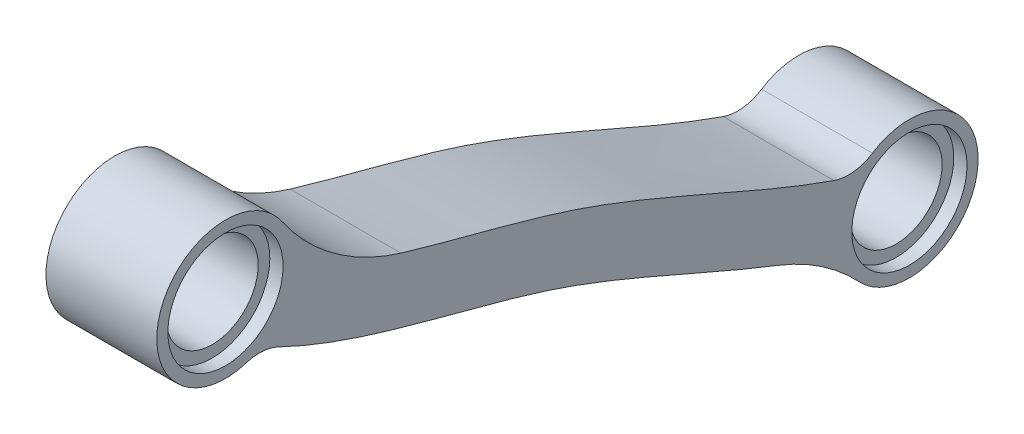
ISO-10303-21;
HEADER;
FILE_DESCRIPTION(('STEP AP214'),'2;1');
FILE_NAME('part.step','',(''),(''),'','','');
FILE_SCHEMA(('AUTOMOTIVE_DESIGN { 1 0 10303 214 1 1 1 1 }'));
ENDSEC;
DATA;
#1=APPLICATION_CONTEXT('core data for automotive mechanical design processes');
#2=APPLICATION_PROTOCOL_DEFINITION('international standard','automotive_design',2000,#1);
#3=PRODUCT_CONTEXT('',#1,'mechanical');
#4=PRODUCT('Part','Part','',(#3));
#5=PRODUCT_RELATED_PRODUCT_CATEGORY('part','',(#4));
#6=PRODUCT_DEFINITION_FORMATION('','',#4);
#7=PRODUCT_DEFINITION_CONTEXT('part definition',#1,'design');
#8=PRODUCT_DEFINITION('design','',#6,#7);
#9=PRODUCT_DEFINITION_SHAPE('','',#8);
#10=(LENGTH_UNIT() NAMED_UNIT(*) SI_UNIT(.MILLI.,.METRE.));
#11=(NAMED_UNIT(*) PLANE_ANGLE_UNIT() SI_UNIT($,.RADIAN.));
#12=(NAMED_UNIT(*) SI_UNIT($,.STERADIAN.) SOLID_ANGLE_UNIT());
#13=UNCERTAINTY_MEASURE_WITH_UNIT(LENGTH_MEASURE(1.E-05),#10,'distance_accuracy_value','');
#14=(GEOMETRIC_REPRESENTATION_CONTEXT(3) GLOBAL_UNCERTAINTY_ASSIGNED_CONTEXT((#13)) GLOBAL_UNIT_ASSIGNED_CONTEXT((#10,
#11,#12)) REPRESENTATION_CONTEXT('',''));
#15=CARTESIAN_POINT('',(0.,0.,0.));
#16=DIRECTION('',(0.,0.,1.));
#17=DIRECTION('',(1.,0.,0.));
#18=AXIS2_PLACEMENT_3D('',#15,#16,#17);
#19=CARTESIAN_POINT('',(2.5,-5.87,-16.305));
#20=DIRECTION('',(-1.,0.,0.));
#21=DIRECTION('',(0.,0.,1.));
#22=AXIS2_PLACEMENT_3D('',#19,#20,#21);
#23=CYLINDRICAL_SURFACE('',#22,2.075);
#24=CARTESIAN_POINT('',(1.9,-5.87,-16.305));
#25=DIRECTION('',(1.,0.,0.));
#26=DIRECTION('',(0.,0.,-1.));
#27=AXIS2_PLACEMENT_3D('',#24,#25,#26);
#28=CIRCLE('',#27,2.075);
#29=CARTESIAN_POINT('',(1.9,-5.87,-18.38));
#30=VERTEX_POINT('',#29);
#31=EDGE_CURVE('E166',#30,#30,#28,.T.);
#32=ORIENTED_EDGE('',*,*,#31,.T.);
#33=EDGE_LOOP('',(#32));
#34=FACE_BOUND('',#33,.T.);
#35=CARTESIAN_POINT('',(-1.9,-5.87,-16.305));
#36=DIRECTION('',(-1.,0.,0.));
#37=DIRECTION('',(0.,0.,1.));
#38=AXIS2_PLACEMENT_3D('',#35,#36,#37);
#39=CIRCLE('',#38,2.075);
#40=CARTESIAN_POINT('',(-1.9,-5.87,-14.23));
#41=VERTEX_POINT('',#40);
#42=EDGE_CURVE('E41',#41,#41,#39,.T.);
#43=ORIENTED_EDGE('',*,*,#42,.T.);
#44=EDGE_LOOP('',(#43));
#45=FACE_BOUND('',#44,.T.);
#46=ADVANCED_FACE('F37',(#34,#45),#23,.F.);
#47=CARTESIAN_POINT('',(2.5,5.62916512459887,14.555));
#48=DIRECTION('',(-1.,0.,0.));
#49=DIRECTION('',(0.,0.,1.));
#50=AXIS2_PLACEMENT_3D('',#47,#48,#49);
#51=CYLINDRICAL_SURFACE('',#50,2.075);
#52=CARTESIAN_POINT('',(1.9,5.62916512459887,14.555));
#53=DIRECTION('',(1.,0.,0.));
#54=DIRECTION('',(0.,0.,-1.));
#55=AXIS2_PLACEMENT_3D('',#52,#53,#54);
#56=CIRCLE('',#55,2.075);
#57=CARTESIAN_POINT('',(1.9,5.62916512459887,12.48));
#58=VERTEX_POINT('',#57);
#59=EDGE_CURVE('E163',#58,#58,#56,.T.);
#60=ORIENTED_EDGE('',*,*,#59,.T.);
#61=EDGE_LOOP('',(#60));
#62=FACE_BOUND('',#61,.T.);
#63=CARTESIAN_POINT('',(-1.9,5.62916512459887,14.555));
#64=DIRECTION('',(-1.,0.,0.));
#65=DIRECTION('',(0.,0.,1.));
#66=AXIS2_PLACEMENT_3D('',#63,#64,#65);
#67=CIRCLE('',#66,2.075);
#68=CARTESIAN_POINT('',(-1.9,5.62916512459887,16.63));
#69=VERTEX_POINT('',#68);
#70=EDGE_CURVE('E170',#69,#69,#67,.T.);
#71=ORIENTED_EDGE('',*,*,#70,.T.);
#72=EDGE_LOOP('',(#71));
#73=FACE_BOUND('',#72,.T.);
#74=ADVANCED_FACE('F214',(#62,#73),#51,.F.);
#75=CARTESIAN_POINT('',(2.5,6.75149239231683,13.7183749453035));
#76=CARTESIAN_POINT('',(2.5,5.21529574726249,11.6574712184713));
#77=CARTESIAN_POINT('',(2.5,3.8045652439948,8.0977433985549));
#78=CARTESIAN_POINT('',(2.5,2.42348900101485,2.79471160747684));
#79=CARTESIAN_POINT('',(2.5,1.28992605093125,-1.3175340197195));
#80=CARTESIAN_POINT('',(2.5,-0.28582223497023,-5.27886044926375));
#81=CARTESIAN_POINT('',(2.5,-1.96664277178266,-9.05302875417027));
#82=CARTESIAN_POINT('',(2.5,-3.49230850772358,-12.7871368155633));
#83=CARTESIAN_POINT('',(2.5,-4.23366741402752,-15.2996206718868));
#84=CARTESIAN_POINT('',(2.5,-4.4986207956868,-16.5872179126285));
#85=B_SPLINE_CURVE_WITH_KNOTS('',3,(#75,#76,#77,#78,#79,#80,#81,#82,#83,#84),.UNSPECIFIED.,.F.,
.F.,(4,1,1,1,1,1,1,4),(0.,0.25,0.375,0.5,0.625,0.75,0.875,1.),.UNSPECIFIED.);
#86=DIRECTION('',(-1.,0.,0.));
#87=VECTOR('',#86,1.);
#88=SURFACE_OF_LINEAR_EXTRUSION('',#85,#87);
#89=CARTESIAN_POINT('',(2.5,3.47471166011879,6.63853959635986));
#90=VERTEX_POINT('',#89);
#91=CARTESIAN_POINT('',(2.5,-3.46122183283833,-12.9010790793141));
#92=VERTEX_POINT('',#91);
#93=EDGE_CURVE('E128',#90,#92,#85,.T.);
#94=ORIENTED_EDGE('',*,*,#93,.T.);
#95=DIRECTION('',(-1.,0.,0.));
#96=VECTOR('',#95,1.);
#97=CARTESIAN_POINT('',(2.5,-3.46122183283837,-12.9010790793142));
#98=LINE('',#97,#96);
#99=CARTESIAN_POINT('',(-2.5,-3.46122183283833,-12.9010790793141));
#100=VERTEX_POINT('',#99);
#101=EDGE_CURVE('E150',#92,#100,#98,.T.);
#102=ORIENTED_EDGE('',*,*,#101,.T.);
#103=CARTESIAN_POINT('',(-2.5,6.75149239231683,13.7183749453035));
#104=CARTESIAN_POINT('',(-2.5,5.21529574726249,11.6574712184713));
#105=CARTESIAN_POINT('',(-2.5,3.8045652439948,8.0977433985549));
#106=CARTESIAN_POINT('',(-2.5,2.42348900101485,2.79471160747684));
#107=CARTESIAN_POINT('',(-2.5,1.28992605093125,-1.3175340197195));
#108=CARTESIAN_POINT('',(-2.5,-0.28582223497023,-5.27886044926375));
#109=CARTESIAN_POINT('',(-2.5,-1.96664277178266,-9.05302875417027));
#110=CARTESIAN_POINT('',(-2.5,-3.49230850772358,-12.7871368155633));
#111=CARTESIAN_POINT('',(-2.5,-4.23366741402752,-15.2996206718868));
#112=CARTESIAN_POINT('',(-2.5,-4.4986207956868,-16.5872179126285));
#113=B_SPLINE_CURVE_WITH_KNOTS('',3,(#103,#104,#105,#106,#107,#108,#109,#110,#111,#112),
.UNSPECIFIED.,.F.,.F.,(4,1,1,1,1,1,1,4),(0.,0.25,0.375,0.5,0.625,0.75,0.875,1.),.UNSPECIFIED.);
#114=CARTESIAN_POINT('',(-2.5,3.47471166011879,6.63853959635986));
#115=VERTEX_POINT('',#114);
#116=EDGE_CURVE('E169',#115,#100,#113,.T.);
#117=ORIENTED_EDGE('',*,*,#116,.F.);
#118=DIRECTION('',(-1.,0.,0.));
#119=VECTOR('',#118,1.);
#120=CARTESIAN_POINT('',(-2.5,3.47471166011879,6.63853959635986));
#121=LINE('',#120,#119);
#122=EDGE_CURVE('E114',#115,#90,#121,.F.);
#123=ORIENTED_EDGE('',*,*,#122,.T.);
#124=EDGE_LOOP('',(#94,#102,#117,#123));
#125=FACE_BOUND('',#124,.T.);
#126=ADVANCED_FACE('F209',(#125),#88,.T.);
#127=CARTESIAN_POINT('',(2.5,5.62916512459887,14.555));
#128=DIRECTION('',(-1.,0.,0.));
#129=DIRECTION('',(0.,0.,1.));
#130=AXIS2_PLACEMENT_3D('',#127,#128,#129);
#131=CYLINDRICAL_SURFACE('',#130,3.10000000000016);
#132=CARTESIAN_POINT('',(-2.5,5.62916512459887,14.555));
#133=DIRECTION('',(1.,0.,0.));
#134=DIRECTION('',(0.,0.,-1.));
#135=AXIS2_PLACEMENT_3D('',#132,#133,#134);
#136=CIRCLE('',#135,3.10000000000016);
#137=CARTESIAN_POINT('',(-2.5,7.38563635360443,12.0006294666442));
#138=VERTEX_POINT('',#137);
#139=CARTESIAN_POINT('',(-2.5,2.67179319756236,13.625510201682));
#140=VERTEX_POINT('',#139);
#141=EDGE_CURVE('E134',#138,#140,#136,.T.);
#142=ORIENTED_EDGE('',*,*,#141,.T.);
#143=DIRECTION('',(-1.,0.,0.));
#144=VECTOR('',#143,1.);
#145=CARTESIAN_POINT('',(2.5,2.67179319756236,13.625510201682));
#146=LINE('',#145,#144);
#147=CARTESIAN_POINT('',(2.5,2.67179319756236,13.625510201682));
#148=VERTEX_POINT('',#147);
#149=EDGE_CURVE('E60',#140,#148,#146,.F.);
#150=ORIENTED_EDGE('',*,*,#149,.T.);
#151=CARTESIAN_POINT('',(2.5,5.62916512459887,14.555));
#152=DIRECTION('',(1.,0.,0.));
#153=DIRECTION('',(0.,0.,-1.));
#154=AXIS2_PLACEMENT_3D('',#151,#152,#153);
#155=CIRCLE('',#154,3.10000000000016);
#156=CARTESIAN_POINT('',(2.5,7.38563635360443,12.0006294666442));
#157=VERTEX_POINT('',#156);
#158=EDGE_CURVE('E132',#157,#148,#155,.T.);
#159=ORIENTED_EDGE('',*,*,#158,.F.);
#160=DIRECTION('',(-1.,0.,0.));
#161=VECTOR('',#160,1.);
#162=CARTESIAN_POINT('',(2.5,7.38563635360443,12.0006294666442));
#163=LINE('',#162,#161);
#164=EDGE_CURVE('E141',#157,#138,#163,.T.);
#165=ORIENTED_EDGE('',*,*,#164,.T.);
#166=EDGE_LOOP('',(#142,#150,#159,#165));
#167=FACE_BOUND('',#166,.T.);
#168=ADVANCED_FACE('F213',(#167),#131,.T.);
#169=CARTESIAN_POINT('',(2.5,4.50692739527193,15.3915729720202));
#170=CARTESIAN_POINT('',(2.5,4.05993657779516,14.7919242687098));
#171=CARTESIAN_POINT('',(2.5,3.23528176405077,13.5218765013183));
#172=CARTESIAN_POINT('',(2.5,1.93206249747692,10.918330349005));
#173=CARTESIAN_POINT('',(2.5,0.763759759014962,7.53841531365976));
#174=CARTESIAN_POINT('',(2.5,-0.293699415832916,3.46927124146217));
#175=CARTESIAN_POINT('',(2.5,-1.37149948324488,-0.432825124131802));
#176=CARTESIAN_POINT('',(2.5,-2.8501970366546,-4.15144493541532));
#177=CARTESIAN_POINT('',(2.5,-4.529354156347,-7.9257264220781));
#178=CARTESIAN_POINT('',(2.5,-5.86062190715722,-11.1760525946051));
#179=CARTESIAN_POINT('',(2.5,-6.73989154941322,-13.8915195038179));
#180=CARTESIAN_POINT('',(2.5,-7.09476340288665,-15.3112920685822));
#181=CARTESIAN_POINT('',(2.5,-7.24119087743251,-16.0228373991153));
#182=B_SPLINE_CURVE_WITH_KNOTS('',3,(#169,#170,#171,#172,#173,#174,#175,#176,#177,#178,#179,
#180,#181),.UNSPECIFIED.,.F.,.F.,(4,1,1,1,1,1,1,1,1,1,4),(0.,0.0625,0.125,0.25,0.375,0.5,0.625,
0.75,0.875,0.9375,1.),.UNSPECIFIED.);
#183=DIRECTION('',(-1.,0.,0.));
#184=VECTOR('',#183,1.);
#185=SURFACE_OF_LINEAR_EXTRUSION('',#182,#184);
#186=CARTESIAN_POINT('',(2.5,2.56593900235888,12.1584664469243));
#187=VERTEX_POINT('',#186);
#188=CARTESIAN_POINT('',(2.5,-5.51228030437413,-10.3747490045417));
#189=VERTEX_POINT('',#188);
#190=EDGE_CURVE('E247',#187,#189,#182,.T.);
#191=ORIENTED_EDGE('',*,*,#190,.F.);
#192=DIRECTION('',(-1.,0.,0.));
#193=VECTOR('',#192,1.);
#194=CARTESIAN_POINT('',(2.5,2.56593900235888,12.1584664469243));
#195=LINE('',#194,#193);
#196=CARTESIAN_POINT('',(-2.5,2.56593900235888,12.1584664469243));
#197=VERTEX_POINT('',#196);
#198=EDGE_CURVE('E155',#187,#197,#195,.T.);
#199=ORIENTED_EDGE('',*,*,#198,.T.);
#200=CARTESIAN_POINT('',(-2.5,4.50692739527193,15.3915729720202));
#201=CARTESIAN_POINT('',(-2.5,4.05993657779516,14.7919242687098));
#202=CARTESIAN_POINT('',(-2.5,3.23528176405077,13.5218765013183));
#203=CARTESIAN_POINT('',(-2.5,1.93206249747692,10.918330349005));
#204=CARTESIAN_POINT('',(-2.5,0.763759759014962,7.53841531365976));
#205=CARTESIAN_POINT('',(-2.5,-0.293699415832916,3.46927124146217));
#206=CARTESIAN_POINT('',(-2.5,-1.37149948324488,-0.432825124131802));
#207=CARTESIAN_POINT('',(-2.5,-2.8501970366546,-4.15144493541532));
#208=CARTESIAN_POINT('',(-2.5,-4.529354156347,-7.9257264220781));
#209=CARTESIAN_POINT('',(-2.5,-5.86062190715722,-11.1760525946051));
#210=CARTESIAN_POINT('',(-2.5,-6.73989154941322,-13.8915195038179));
#211=CARTESIAN_POINT('',(-2.5,-7.09476340288665,-15.3112920685822));
#212=CARTESIAN_POINT('',(-2.5,-7.24119087743251,-16.0228373991153));
#213=B_SPLINE_CURVE_WITH_KNOTS('',3,(#200,#201,#202,#203,#204,#205,#206,#207,#208,#209,#210,
#211,#212),.UNSPECIFIED.,.F.,.F.,(4,1,1,1,1,1,1,1,1,1,4),(0.,0.0625,0.125,0.25,0.375,0.5,0.625,
0.75,0.875,0.9375,1.),.UNSPECIFIED.);
#214=CARTESIAN_POINT('',(-2.5,-5.51228030437413,-10.3747490045417));
#215=VERTEX_POINT('',#214);
#216=EDGE_CURVE('E129',#197,#215,#213,.T.);
#217=ORIENTED_EDGE('',*,*,#216,.T.);
#218=DIRECTION('',(-1.,0.,0.));
#219=VECTOR('',#218,1.);
#220=CARTESIAN_POINT('',(-2.5,-5.51228030437413,-10.3747490045417));
#221=LINE('',#220,#219);
#222=EDGE_CURVE('E111',#215,#189,#221,.F.);
#223=ORIENTED_EDGE('',*,*,#222,.T.);
#224=EDGE_LOOP('',(#191,#199,#217,#223));
#225=FACE_BOUND('',#224,.T.);
#226=ADVANCED_FACE('F244',(#225),#185,.F.);
#227=CARTESIAN_POINT('',(2.5,-5.87,-16.305));
#228=DIRECTION('',(-1.,0.,0.));
#229=DIRECTION('',(0.,0.,1.));
#230=AXIS2_PLACEMENT_3D('',#227,#228,#229);
#231=CYLINDRICAL_SURFACE('',#230,3.1);
#232=CARTESIAN_POINT('',(-2.5,-5.87,-16.305));
#233=DIRECTION('',(1.,0.,0.));
#234=DIRECTION('',(0.,0.,-1.));
#235=AXIS2_PLACEMENT_3D('',#232,#233,#234);
#236=CIRCLE('',#235,3.1);
#237=CARTESIAN_POINT('',(-2.5,-7.99090041803844,-14.0440750970533));
#238=VERTEX_POINT('',#237);
#239=CARTESIAN_POINT('',(-2.5,-3.25778327309678,-14.6357715040513));
#240=VERTEX_POINT('',#239);
#241=EDGE_CURVE('E120',#238,#240,#236,.T.);
#242=ORIENTED_EDGE('',*,*,#241,.T.);
#243=DIRECTION('',(-1.,0.,0.));
#244=VECTOR('',#243,1.);
#245=CARTESIAN_POINT('',(2.5,-3.25778327309678,-14.6357715040513));
#246=LINE('',#245,#244);
#247=CARTESIAN_POINT('',(2.5,-3.25778327309678,-14.6357715040513));
#248=VERTEX_POINT('',#247);
#249=EDGE_CURVE('E153',#240,#248,#246,.F.);
#250=ORIENTED_EDGE('',*,*,#249,.T.);
#251=CARTESIAN_POINT('',(2.5,-5.87,-16.305));
#252=DIRECTION('',(1.,0.,0.));
#253=DIRECTION('',(0.,0.,-1.));
#254=AXIS2_PLACEMENT_3D('',#251,#252,#253);
#255=CIRCLE('',#254,3.1);
#256=CARTESIAN_POINT('',(2.5,-7.99090041803844,-14.0440750970533));
#257=VERTEX_POINT('',#256);
#258=EDGE_CURVE('E123',#257,#248,#255,.T.);
#259=ORIENTED_EDGE('',*,*,#258,.F.);
#260=DIRECTION('',(-1.,0.,0.));
#261=VECTOR('',#260,1.);
#262=CARTESIAN_POINT('',(2.5,-7.99090041803844,-14.0440750970533));
#263=LINE('',#262,#261);
#264=EDGE_CURVE('E109',#257,#238,#263,.T.);
#265=ORIENTED_EDGE('',*,*,#264,.T.);
#266=EDGE_LOOP('',(#242,#250,#259,#265));
#267=FACE_BOUND('',#266,.T.);
#268=ADVANCED_FACE('F119',(#267),#231,.T.);
#269=CARTESIAN_POINT('',(2.5,0.,0.));
#270=DIRECTION('',(1.,0.,0.));
#271=DIRECTION('',(0.,0.,-1.));
#272=AXIS2_PLACEMENT_3D('',#269,#270,#271);
#273=PLANE('',#272);
#274=CARTESIAN_POINT('',(2.5,5.62916512459887,14.555));
#275=DIRECTION('',(1.,0.,0.));
#276=DIRECTION('',(0.,0.,-1.));
#277=AXIS2_PLACEMENT_3D('',#274,#275,#276);
#278=CIRCLE('',#277,2.6);
#279=CARTESIAN_POINT('',(2.5,5.62916512459887,11.955));
#280=VERTEX_POINT('',#279);
#281=EDGE_CURVE('E193',#280,#280,#278,.T.);
#282=ORIENTED_EDGE('',*,*,#281,.F.);
#283=EDGE_LOOP('',(#282));
#284=FACE_BOUND('',#283,.T.);
#285=CARTESIAN_POINT('',(2.5,-5.87,-16.305));
#286=DIRECTION('',(1.,0.,0.));
#287=DIRECTION('',(0.,0.,-1.));
#288=AXIS2_PLACEMENT_3D('',#285,#286,#287);
#289=CIRCLE('',#288,2.6);
#290=CARTESIAN_POINT('',(2.5,-5.87,-18.905));
#291=VERTEX_POINT('',#290);
#292=EDGE_CURVE('E176',#291,#291,#289,.T.);
#293=ORIENTED_EDGE('',*,*,#292,.F.);
#294=EDGE_LOOP('',(#293));
#295=FACE_BOUND('',#294,.T.);
#296=ORIENTED_EDGE('',*,*,#93,.F.);
#297=CARTESIAN_POINT('',(2.5,13.0516725762032,3.76072452033467));
#298=DIRECTION('',(1.,0.,0.));
#299=DIRECTION('',(0.,0.,-1.));
#300=AXIS2_PLACEMENT_3D('',#297,#298,#299);
#301=CIRCLE('',#300,10.);
#302=EDGE_CURVE('E148',#90,#157,#301,.F.);
#303=ORIENTED_EDGE('',*,*,#302,.T.);
#304=ORIENTED_EDGE('',*,*,#158,.T.);
#305=CARTESIAN_POINT('',(2.5,0.763811309151796,13.0258393640575));
#306=DIRECTION('',(1.,0.,0.));
#307=DIRECTION('',(0.,0.,-1.));
#308=AXIS2_PLACEMENT_3D('',#305,#306,#307);
#309=CIRCLE('',#308,2.);
#310=EDGE_CURVE('E11',#148,#187,#309,.F.);
#311=ORIENTED_EDGE('',*,*,#310,.T.);
#312=ORIENTED_EDGE('',*,*,#190,.T.);
#313=CARTESIAN_POINT('',(2.5,-14.8325146697754,-6.75076895851574));
#314=DIRECTION('',(1.,0.,0.));
#315=DIRECTION('',(0.,0.,-1.));
#316=AXIS2_PLACEMENT_3D('',#313,#314,#315);
#317=CIRCLE('',#316,10.);
#318=EDGE_CURVE('E113',#189,#257,#317,.F.);
#319=ORIENTED_EDGE('',*,*,#318,.T.);
#320=ORIENTED_EDGE('',*,*,#258,.T.);
#321=CARTESIAN_POINT('',(2.5,-1.57248215896566,-13.5588498937619));
#322=DIRECTION('',(1.,0.,0.));
#323=DIRECTION('',(0.,0.,-1.));
#324=AXIS2_PLACEMENT_3D('',#321,#322,#323);
#325=CIRCLE('',#324,2.);
#326=EDGE_CURVE('E160',#248,#92,#325,.F.);
#327=ORIENTED_EDGE('',*,*,#326,.T.);
#328=EDGE_LOOP('',(#296,#303,#304,#311,#312,#319,#320,#327));
#329=FACE_BOUND('',#328,.T.);
#330=ADVANCED_FACE('F243',(#284,#295,#329),#273,.T.);
#331=CARTESIAN_POINT('',(-2.5,0.,0.));
#332=DIRECTION('',(1.,0.,0.));
#333=DIRECTION('',(0.,0.,-1.));
#334=AXIS2_PLACEMENT_3D('',#331,#332,#333);
#335=PLANE('',#334);
#336=CARTESIAN_POINT('',(-2.5,5.62916512459887,14.555));
#337=DIRECTION('',(-1.,0.,0.));
#338=DIRECTION('',(0.,0.,1.));
#339=AXIS2_PLACEMENT_3D('',#336,#337,#338);
#340=CIRCLE('',#339,2.6);
#341=CARTESIAN_POINT('',(-2.5,5.62916512459887,17.155));
#342=VERTEX_POINT('',#341);
#343=EDGE_CURVE('E178',#342,#342,#340,.T.);
#344=ORIENTED_EDGE('',*,*,#343,.F.);
#345=EDGE_LOOP('',(#344));
#346=FACE_BOUND('',#345,.T.);
#347=CARTESIAN_POINT('',(-2.5,-5.87,-16.305));
#348=DIRECTION('',(-1.,0.,0.));
#349=DIRECTION('',(0.,0.,1.));
#350=AXIS2_PLACEMENT_3D('',#347,#348,#349);
#351=CIRCLE('',#350,2.6);
#352=CARTESIAN_POINT('',(-2.5,-5.87,-13.705));
#353=VERTEX_POINT('',#352);
#354=EDGE_CURVE('E188',#353,#353,#351,.T.);
#355=ORIENTED_EDGE('',*,*,#354,.F.);
#356=EDGE_LOOP('',(#355));
#357=FACE_BOUND('',#356,.T.);
#358=ORIENTED_EDGE('',*,*,#141,.F.);
#359=CARTESIAN_POINT('',(-2.5,13.0516725762032,3.76072452033467));
#360=DIRECTION('',(1.,0.,0.));
#361=DIRECTION('',(0.,0.,-1.));
#362=AXIS2_PLACEMENT_3D('',#359,#360,#361);
#363=CIRCLE('',#362,10.);
#364=EDGE_CURVE('E146',#138,#115,#363,.T.);
#365=ORIENTED_EDGE('',*,*,#364,.T.);
#366=ORIENTED_EDGE('',*,*,#116,.T.);
#367=CARTESIAN_POINT('',(-2.5,-1.57248215896566,-13.5588498937619));
#368=DIRECTION('',(1.,0.,0.));
#369=DIRECTION('',(0.,0.,-1.));
#370=AXIS2_PLACEMENT_3D('',#367,#368,#369);
#371=CIRCLE('',#370,2.);
#372=EDGE_CURVE('E127',#100,#240,#371,.T.);
#373=ORIENTED_EDGE('',*,*,#372,.T.);
#374=ORIENTED_EDGE('',*,*,#241,.F.);
#375=CARTESIAN_POINT('',(-2.5,-14.8325146697754,-6.75076895851574));
#376=DIRECTION('',(1.,0.,0.));
#377=DIRECTION('',(0.,0.,-1.));
#378=AXIS2_PLACEMENT_3D('',#375,#376,#377);
#379=CIRCLE('',#378,10.);
#380=EDGE_CURVE('E105',#238,#215,#379,.T.);
#381=ORIENTED_EDGE('',*,*,#380,.T.);
#382=ORIENTED_EDGE('',*,*,#216,.F.);
#383=CARTESIAN_POINT('',(-2.5,0.763811309151796,13.0258393640575));
#384=DIRECTION('',(1.,0.,0.));
#385=DIRECTION('',(0.,0.,-1.));
#386=AXIS2_PLACEMENT_3D('',#383,#384,#385);
#387=CIRCLE('',#386,2.);
#388=EDGE_CURVE('E46',#197,#140,#387,.T.);
#389=ORIENTED_EDGE('',*,*,#388,.T.);
#390=EDGE_LOOP('',(#358,#365,#366,#373,#374,#381,#382,#389));
#391=FACE_BOUND('',#390,.T.);
#392=ADVANCED_FACE('F125',(#346,#357,#391),#335,.F.);
#393=CARTESIAN_POINT('',(0.,-14.8325146697754,-6.75076895851574));
#394=DIRECTION('',(-1.,0.,0.));
#395=DIRECTION('',(0.,0.,1.));
#396=AXIS2_PLACEMENT_3D('',#393,#394,#395);
#397=CYLINDRICAL_SURFACE('',#396,10.);
#398=ORIENTED_EDGE('',*,*,#318,.F.);
#399=ORIENTED_EDGE('',*,*,#222,.F.);
#400=ORIENTED_EDGE('',*,*,#380,.F.);
#401=ORIENTED_EDGE('',*,*,#264,.F.);
#402=EDGE_LOOP('',(#398,#399,#400,#401));
#403=FACE_BOUND('',#402,.T.);
#404=ADVANCED_FACE('F108',(#403),#397,.F.);
#405=CARTESIAN_POINT('',(0.,13.0516725762032,3.76072452033467));
#406=DIRECTION('',(-1.,0.,0.));
#407=DIRECTION('',(0.,0.,1.));
#408=AXIS2_PLACEMENT_3D('',#405,#406,#407);
#409=CYLINDRICAL_SURFACE('',#408,10.);
#410=ORIENTED_EDGE('',*,*,#302,.F.);
#411=ORIENTED_EDGE('',*,*,#122,.F.);
#412=ORIENTED_EDGE('',*,*,#364,.F.);
#413=ORIENTED_EDGE('',*,*,#164,.F.);
#414=EDGE_LOOP('',(#410,#411,#412,#413));
#415=FACE_BOUND('',#414,.T.);
#416=ADVANCED_FACE('F219',(#415),#409,.F.);
#417=CARTESIAN_POINT('',(0.,-1.57248215896566,-13.5588498937619));
#418=DIRECTION('',(-1.,0.,0.));
#419=DIRECTION('',(0.,0.,1.));
#420=AXIS2_PLACEMENT_3D('',#417,#418,#419);
#421=CYLINDRICAL_SURFACE('',#420,2.);
#422=ORIENTED_EDGE('',*,*,#326,.F.);
#423=ORIENTED_EDGE('',*,*,#249,.F.);
#424=ORIENTED_EDGE('',*,*,#372,.F.);
#425=ORIENTED_EDGE('',*,*,#101,.F.);
#426=EDGE_LOOP('',(#422,#423,#424,#425));
#427=FACE_BOUND('',#426,.T.);
#428=ADVANCED_FACE('F221',(#427),#421,.F.);
#429=CARTESIAN_POINT('',(0.,0.763811309151796,13.0258393640575));
#430=DIRECTION('',(-1.,0.,0.));
#431=DIRECTION('',(0.,0.,1.));
#432=AXIS2_PLACEMENT_3D('',#429,#430,#431);
#433=CYLINDRICAL_SURFACE('',#432,2.);
#434=ORIENTED_EDGE('',*,*,#310,.F.);
#435=ORIENTED_EDGE('',*,*,#149,.F.);
#436=ORIENTED_EDGE('',*,*,#388,.F.);
#437=ORIENTED_EDGE('',*,*,#198,.F.);
#438=EDGE_LOOP('',(#434,#435,#436,#437));
#439=FACE_BOUND('',#438,.T.);
#440=ADVANCED_FACE('F39',(#439),#433,.F.);
#441=CARTESIAN_POINT('',(1.9,-5.87,-16.305));
#442=DIRECTION('',(1.,0.,0.));
#443=DIRECTION('',(0.,0.,-1.));
#444=AXIS2_PLACEMENT_3D('',#441,#442,#443);
#445=CYLINDRICAL_SURFACE('',#444,2.6);
#446=CARTESIAN_POINT('',(1.9,-5.87,-16.305));
#447=DIRECTION('',(1.,0.,0.));
#448=DIRECTION('',(0.,0.,-1.));
#449=AXIS2_PLACEMENT_3D('',#446,#447,#448);
#450=CIRCLE('',#449,2.6);
#451=CARTESIAN_POINT('',(1.9,-5.87,-18.905));
#452=VERTEX_POINT('',#451);
#453=EDGE_CURVE('E196',#452,#452,#450,.T.);
#454=ORIENTED_EDGE('',*,*,#453,.F.);
#455=EDGE_LOOP('',(#454));
#456=FACE_BOUND('',#455,.T.);
#457=ORIENTED_EDGE('',*,*,#292,.T.);
#458=EDGE_LOOP('',(#457));
#459=FACE_BOUND('',#458,.T.);
#460=ADVANCED_FACE('F228',(#456,#459),#445,.F.);
#461=CARTESIAN_POINT('',(1.9,-5.87,-16.305));
#462=DIRECTION('',(1.,0.,0.));
#463=DIRECTION('',(0.,0.,-1.));
#464=AXIS2_PLACEMENT_3D('',#461,#462,#463);
#465=PLANE('',#464);
#466=ORIENTED_EDGE('',*,*,#31,.F.);
#467=EDGE_LOOP('',(#466));
#468=FACE_BOUND('',#467,.T.);
#469=ORIENTED_EDGE('',*,*,#453,.T.);
#470=EDGE_LOOP('',(#469));
#471=FACE_BOUND('',#470,.T.);
#472=ADVANCED_FACE('F283',(#468,#471),#465,.T.);
#473=CARTESIAN_POINT('',(1.9,5.62916512459887,14.555));
#474=DIRECTION('',(1.,0.,0.));
#475=DIRECTION('',(0.,0.,-1.));
#476=AXIS2_PLACEMENT_3D('',#473,#474,#475);
#477=CYLINDRICAL_SURFACE('',#476,2.6);
#478=CARTESIAN_POINT('',(1.9,5.62916512459887,14.555));
#479=DIRECTION('',(1.,0.,0.));
#480=DIRECTION('',(0.,0.,-1.));
#481=AXIS2_PLACEMENT_3D('',#478,#479,#480);
#482=CIRCLE('',#481,2.6);
#483=CARTESIAN_POINT('',(1.9,5.62916512459887,11.955));
#484=VERTEX_POINT('',#483);
#485=EDGE_CURVE('E167',#484,#484,#482,.T.);
#486=ORIENTED_EDGE('',*,*,#485,.F.);
#487=EDGE_LOOP('',(#486));
#488=FACE_BOUND('',#487,.T.);
#489=ORIENTED_EDGE('',*,*,#281,.T.);
#490=EDGE_LOOP('',(#489));
#491=FACE_BOUND('',#490,.T.);
#492=ADVANCED_FACE('F287',(#488,#491),#477,.F.);
#493=CARTESIAN_POINT('',(1.9,5.62916512459887,14.555));
#494=DIRECTION('',(1.,0.,0.));
#495=DIRECTION('',(0.,0.,-1.));
#496=AXIS2_PLACEMENT_3D('',#493,#494,#495);
#497=PLANE('',#496);
#498=ORIENTED_EDGE('',*,*,#59,.F.);
#499=EDGE_LOOP('',(#498));
#500=FACE_BOUND('',#499,.T.);
#501=ORIENTED_EDGE('',*,*,#485,.T.);
#502=EDGE_LOOP('',(#501));
#503=FACE_BOUND('',#502,.T.);
#504=ADVANCED_FACE('F291',(#500,#503),#497,.T.);
#505=CARTESIAN_POINT('',(-1.9,-5.87,-16.305));
#506=DIRECTION('',(-1.,0.,0.));
#507=DIRECTION('',(0.,0.,1.));
#508=AXIS2_PLACEMENT_3D('',#505,#506,#507);
#509=CYLINDRICAL_SURFACE('',#508,2.6);
#510=CARTESIAN_POINT('',(-1.9,-5.87,-16.305));
#511=DIRECTION('',(-1.,0.,0.));
#512=DIRECTION('',(0.,0.,1.));
#513=AXIS2_PLACEMENT_3D('',#510,#511,#512);
#514=CIRCLE('',#513,2.6);
#515=CARTESIAN_POINT('',(-1.9,-5.87,-13.705));
#516=VERTEX_POINT('',#515);
#517=EDGE_CURVE('E183',#516,#516,#514,.T.);
#518=ORIENTED_EDGE('',*,*,#517,.F.);
#519=EDGE_LOOP('',(#518));
#520=FACE_BOUND('',#519,.T.);
#521=ORIENTED_EDGE('',*,*,#354,.T.);
#522=EDGE_LOOP('',(#521));
#523=FACE_BOUND('',#522,.T.);
#524=ADVANCED_FACE('F295',(#520,#523),#509,.F.);
#525=CARTESIAN_POINT('',(-1.9,-5.87,-16.305));
#526=DIRECTION('',(-1.,0.,0.));
#527=DIRECTION('',(0.,0.,1.));
#528=AXIS2_PLACEMENT_3D('',#525,#526,#527);
#529=PLANE('',#528);
#530=ORIENTED_EDGE('',*,*,#42,.F.);
#531=EDGE_LOOP('',(#530));
#532=FACE_BOUND('',#531,.T.);
#533=ORIENTED_EDGE('',*,*,#517,.T.);
#534=EDGE_LOOP('',(#533));
#535=FACE_BOUND('',#534,.T.);
#536=ADVANCED_FACE('F299',(#532,#535),#529,.T.);
#537=CARTESIAN_POINT('',(-1.9,5.62916512459887,14.555));
#538=DIRECTION('',(-1.,0.,0.));
#539=DIRECTION('',(0.,0.,1.));
#540=AXIS2_PLACEMENT_3D('',#537,#538,#539);
#541=CYLINDRICAL_SURFACE('',#540,2.6);
#542=CARTESIAN_POINT('',(-1.9,5.62916512459887,14.555));
#543=DIRECTION('',(-1.,0.,0.));
#544=DIRECTION('',(0.,0.,1.));
#545=AXIS2_PLACEMENT_3D('',#542,#543,#544);
#546=CIRCLE('',#545,2.6);
#547=CARTESIAN_POINT('',(-1.9,5.62916512459887,17.155));
#548=VERTEX_POINT('',#547);
#549=EDGE_CURVE('E172',#548,#548,#546,.T.);
#550=ORIENTED_EDGE('',*,*,#549,.F.);
#551=EDGE_LOOP('',(#550));
#552=FACE_BOUND('',#551,.T.);
#553=ORIENTED_EDGE('',*,*,#343,.T.);
#554=EDGE_LOOP('',(#553));
#555=FACE_BOUND('',#554,.T.);
#556=ADVANCED_FACE('F303',(#552,#555),#541,.F.);
#557=CARTESIAN_POINT('',(-1.9,5.62916512459887,14.555));
#558=DIRECTION('',(-1.,0.,0.));
#559=DIRECTION('',(0.,0.,1.));
#560=AXIS2_PLACEMENT_3D('',#557,#558,#559);
#561=PLANE('',#560);
#562=ORIENTED_EDGE('',*,*,#70,.F.);
#563=EDGE_LOOP('',(#562));
#564=FACE_BOUND('',#563,.T.);
#565=ORIENTED_EDGE('',*,*,#549,.T.);
#566=EDGE_LOOP('',(#565));
#567=FACE_BOUND('',#566,.T.);
#568=ADVANCED_FACE('F307',(#564,#567),#561,.T.);
#569=CLOSED_SHELL('',(#46,#74,#126,#168,#226,#268,#330,#392,#404,#416,#428,#440,#460,#472,#492,
#504,#524,#536,#556,#568));
#570=MANIFOLD_SOLID_BREP('B2',#569);
#571=ADVANCED_BREP_SHAPE_REPRESENTATION('',(#18,#570),#14);
#572=SHAPE_DEFINITION_REPRESENTATION(#9,#571);
ENDSEC;
END-ISO-10303-21;
